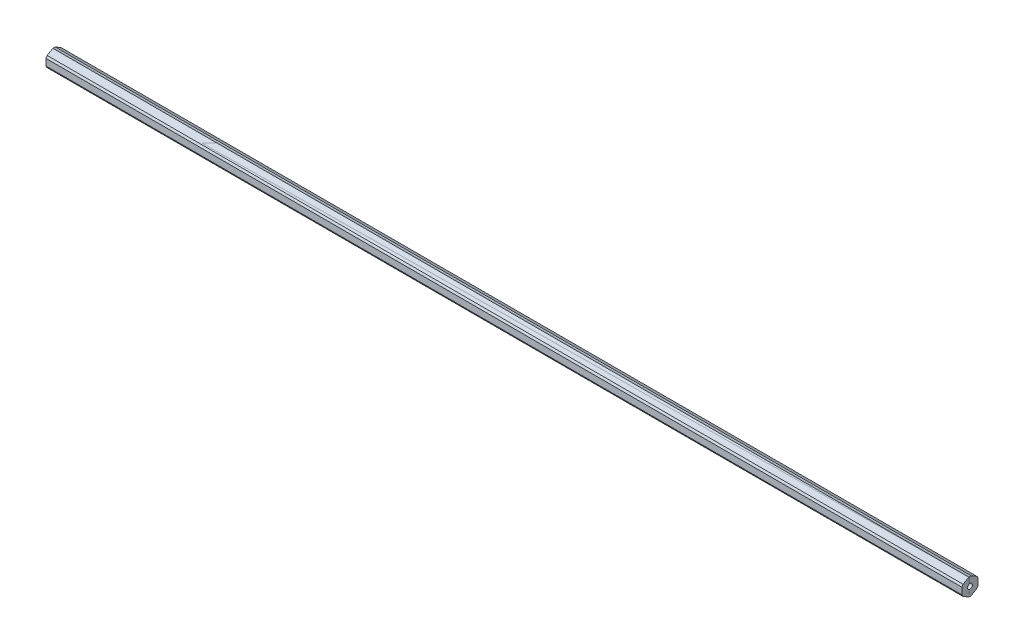
ISO-10303-21;
HEADER;
FILE_DESCRIPTION(('STEP AP214'),'2;1');
FILE_NAME('part.step','',(''),(''),'','','');
FILE_SCHEMA(('AUTOMOTIVE_DESIGN { 1 0 10303 214 1 1 1 1 }'));
ENDSEC;
DATA;
#1=APPLICATION_CONTEXT('core data for automotive mechanical design processes');
#2=APPLICATION_PROTOCOL_DEFINITION('international standard','automotive_design',2000,#1);
#3=PRODUCT_CONTEXT('',#1,'mechanical');
#4=PRODUCT('Part','Part','',(#3));
#5=PRODUCT_RELATED_PRODUCT_CATEGORY('part','',(#4));
#6=PRODUCT_DEFINITION_FORMATION('','',#4);
#7=PRODUCT_DEFINITION_CONTEXT('part definition',#1,'design');
#8=PRODUCT_DEFINITION('design','',#6,#7);
#9=PRODUCT_DEFINITION_SHAPE('','',#8);
#10=(LENGTH_UNIT() NAMED_UNIT(*) SI_UNIT(.MILLI.,.METRE.));
#11=(NAMED_UNIT(*) PLANE_ANGLE_UNIT() SI_UNIT($,.RADIAN.));
#12=(NAMED_UNIT(*) SI_UNIT($,.STERADIAN.) SOLID_ANGLE_UNIT());
#13=UNCERTAINTY_MEASURE_WITH_UNIT(LENGTH_MEASURE(1.E-05),#10,'distance_accuracy_value','');
#14=(GEOMETRIC_REPRESENTATION_CONTEXT(3) GLOBAL_UNCERTAINTY_ASSIGNED_CONTEXT((#13)) GLOBAL_UNIT_ASSIGNED_CONTEXT((#10,
#11,#12)) REPRESENTATION_CONTEXT('',''));
#15=CARTESIAN_POINT('',(0.,0.,0.));
#16=DIRECTION('',(0.,0.,1.));
#17=DIRECTION('',(1.,0.,0.));
#18=AXIS2_PLACEMENT_3D('',#15,#16,#17);
#19=CARTESIAN_POINT('',(552.45,0.,0.));
#20=DIRECTION('',(1.,0.,0.));
#21=DIRECTION('',(0.,0.,-1.));
#22=AXIS2_PLACEMENT_3D('',#19,#20,#21);
#23=CYLINDRICAL_SURFACE('',#22,6.865);
#24=CARTESIAN_POINT('',(1276.35,0.,0.));
#25=DIRECTION('',(1.,0.,0.));
#26=DIRECTION('',(0.,0.,-1.));
#27=AXIS2_PLACEMENT_3D('',#24,#25,#26);
#28=CIRCLE('',#27,6.865);
#29=CARTESIAN_POINT('',(1276.35,-2.608778449773,6.35));
#30=VERTEX_POINT('',#29);
#31=CARTESIAN_POINT('',(1276.35,-4.19487208914468,5.43426841034881));
#32=VERTEX_POINT('',#31);
#33=EDGE_CURVE('E169',#30,#32,#28,.T.);
#34=ORIENTED_EDGE('',*,*,#33,.F.);
#35=DIRECTION('',(1.,0.,0.));
#36=VECTOR('',#35,1.);
#37=CARTESIAN_POINT('',(552.45,-2.608778449773,6.35));
#38=LINE('',#37,#36);
#39=CARTESIAN_POINT('',(552.45,-2.608778449773,6.35));
#40=VERTEX_POINT('',#39);
#41=EDGE_CURVE('E12',#40,#30,#38,.T.);
#42=ORIENTED_EDGE('',*,*,#41,.F.);
#43=CARTESIAN_POINT('',(552.45,0.,0.));
#44=DIRECTION('',(1.,0.,0.));
#45=DIRECTION('',(0.,0.,-1.));
#46=AXIS2_PLACEMENT_3D('',#43,#44,#45);
#47=CIRCLE('',#46,6.865);
#48=CARTESIAN_POINT('',(552.45,-4.19487208914468,5.43426841034881));
#49=VERTEX_POINT('',#48);
#50=EDGE_CURVE('E202',#40,#49,#47,.T.);
#51=ORIENTED_EDGE('',*,*,#50,.T.);
#52=DIRECTION('',(1.,0.,0.));
#53=VECTOR('',#52,1.);
#54=CARTESIAN_POINT('',(552.45,-4.19487208914468,5.43426841034881));
#55=LINE('',#54,#53);
#56=EDGE_CURVE('E55',#49,#32,#55,.T.);
#57=ORIENTED_EDGE('',*,*,#56,.T.);
#58=EDGE_LOOP('',(#34,#42,#51,#57));
#59=FACE_BOUND('',#58,.T.);
#60=ADVANCED_FACE('F47',(#59),#23,.T.);
#61=CARTESIAN_POINT('',(552.45,2.608778449773,6.35));
#62=DIRECTION('',(0.,0.,1.));
#63=DIRECTION('',(1.,0.,0.));
#64=AXIS2_PLACEMENT_3D('',#61,#62,#63);
#65=PLANE('',#64);
#66=DIRECTION('',(0.,-1.,0.));
#67=VECTOR('',#66,1.);
#68=CARTESIAN_POINT('',(1276.35,2.608778449773,6.35));
#69=LINE('',#68,#67);
#70=CARTESIAN_POINT('',(1276.35,2.608778449773,6.35));
#71=VERTEX_POINT('',#70);
#72=EDGE_CURVE('E201',#71,#30,#69,.T.);
#73=ORIENTED_EDGE('',*,*,#72,.F.);
#74=DIRECTION('',(1.,0.,0.));
#75=VECTOR('',#74,1.);
#76=CARTESIAN_POINT('',(552.45,2.608778449773,6.35));
#77=LINE('',#76,#75);
#78=CARTESIAN_POINT('',(552.45,2.608778449773,6.35));
#79=VERTEX_POINT('',#78);
#80=EDGE_CURVE('E59',#79,#71,#77,.T.);
#81=ORIENTED_EDGE('',*,*,#80,.F.);
#82=DIRECTION('',(0.,-1.,0.));
#83=VECTOR('',#82,1.);
#84=CARTESIAN_POINT('',(552.45,2.608778449773,6.35));
#85=LINE('',#84,#83);
#86=EDGE_CURVE('E158',#79,#40,#85,.T.);
#87=ORIENTED_EDGE('',*,*,#86,.T.);
#88=ORIENTED_EDGE('',*,*,#41,.T.);
#89=EDGE_LOOP('',(#73,#81,#87,#88));
#90=FACE_BOUND('',#89,.T.);
#91=ADVANCED_FACE('F221',(#90),#65,.T.);
#92=CARTESIAN_POINT('',(552.45,0.,0.));
#93=DIRECTION('',(1.,0.,0.));
#94=DIRECTION('',(0.,0.,-1.));
#95=AXIS2_PLACEMENT_3D('',#92,#93,#94);
#96=CYLINDRICAL_SURFACE('',#95,6.865);
#97=CARTESIAN_POINT('',(1276.35,0.,0.));
#98=DIRECTION('',(1.,0.,0.));
#99=DIRECTION('',(0.,0.,-1.));
#100=AXIS2_PLACEMENT_3D('',#97,#98,#99);
#101=CIRCLE('',#100,6.865);
#102=CARTESIAN_POINT('',(1276.35,4.19487208914468,5.43426841034881));
#103=VERTEX_POINT('',#102);
#104=EDGE_CURVE('E150',#103,#71,#101,.T.);
#105=ORIENTED_EDGE('',*,*,#104,.F.);
#106=DIRECTION('',(1.,0.,0.));
#107=VECTOR('',#106,1.);
#108=CARTESIAN_POINT('',(552.45,4.19487208914468,5.43426841034881));
#109=LINE('',#108,#107);
#110=CARTESIAN_POINT('',(552.45,4.19487208914468,5.43426841034881));
#111=VERTEX_POINT('',#110);
#112=EDGE_CURVE('E145',#111,#103,#109,.T.);
#113=ORIENTED_EDGE('',*,*,#112,.F.);
#114=CARTESIAN_POINT('',(552.45,0.,0.));
#115=DIRECTION('',(1.,0.,0.));
#116=DIRECTION('',(0.,0.,-1.));
#117=AXIS2_PLACEMENT_3D('',#114,#115,#116);
#118=CIRCLE('',#117,6.865);
#119=EDGE_CURVE('E144',#111,#79,#118,.T.);
#120=ORIENTED_EDGE('',*,*,#119,.T.);
#121=ORIENTED_EDGE('',*,*,#80,.T.);
#122=EDGE_LOOP('',(#105,#113,#120,#121));
#123=FACE_BOUND('',#122,.T.);
#124=ADVANCED_FACE('F142',(#123),#96,.T.);
#125=CARTESIAN_POINT('',(552.45,6.80365053891768,0.915731589651197));
#126=DIRECTION('',(0.,0.866025403784439,0.5));
#127=DIRECTION('',(0.,-0.5,0.866025403784439));
#128=AXIS2_PLACEMENT_3D('',#125,#126,#127);
#129=PLANE('',#128);
#130=DIRECTION('',(0.,-0.5,0.866025403784439));
#131=VECTOR('',#130,1.);
#132=CARTESIAN_POINT('',(1276.35,6.80365053891768,0.915731589651197));
#133=LINE('',#132,#131);
#134=CARTESIAN_POINT('',(1276.35,6.80365053891768,0.915731589651197));
#135=VERTEX_POINT('',#134);
#136=EDGE_CURVE('E198',#135,#103,#133,.T.);
#137=ORIENTED_EDGE('',*,*,#136,.F.);
#138=DIRECTION('',(1.,0.,0.));
#139=VECTOR('',#138,1.);
#140=CARTESIAN_POINT('',(552.45,6.80365053891768,0.915731589651197));
#141=LINE('',#140,#139);
#142=CARTESIAN_POINT('',(552.45,6.80365053891768,0.915731589651197));
#143=VERTEX_POINT('',#142);
#144=EDGE_CURVE('E155',#143,#135,#141,.T.);
#145=ORIENTED_EDGE('',*,*,#144,.F.);
#146=DIRECTION('',(0.,-0.5,0.866025403784439));
#147=VECTOR('',#146,1.);
#148=CARTESIAN_POINT('',(552.45,6.80365053891768,0.915731589651197));
#149=LINE('',#148,#147);
#150=EDGE_CURVE('E159',#143,#111,#149,.T.);
#151=ORIENTED_EDGE('',*,*,#150,.T.);
#152=ORIENTED_EDGE('',*,*,#112,.T.);
#153=EDGE_LOOP('',(#137,#145,#151,#152));
#154=FACE_BOUND('',#153,.T.);
#155=ADVANCED_FACE('F165',(#154),#129,.T.);
#156=CARTESIAN_POINT('',(552.45,0.,0.));
#157=DIRECTION('',(1.,0.,0.));
#158=DIRECTION('',(0.,0.,-1.));
#159=AXIS2_PLACEMENT_3D('',#156,#157,#158);
#160=CYLINDRICAL_SURFACE('',#159,6.865);
#161=CARTESIAN_POINT('',(1276.35,0.,0.));
#162=DIRECTION('',(1.,0.,0.));
#163=DIRECTION('',(0.,0.,-1.));
#164=AXIS2_PLACEMENT_3D('',#161,#162,#163);
#165=CIRCLE('',#164,6.865);
#166=CARTESIAN_POINT('',(1276.35,6.80365053891768,-0.915731589651197));
#167=VERTEX_POINT('',#166);
#168=EDGE_CURVE('E194',#167,#135,#165,.T.);
#169=ORIENTED_EDGE('',*,*,#168,.F.);
#170=DIRECTION('',(1.,0.,0.));
#171=VECTOR('',#170,1.);
#172=CARTESIAN_POINT('',(552.45,6.80365053891768,-0.915731589651197));
#173=LINE('',#172,#171);
#174=CARTESIAN_POINT('',(552.45,6.80365053891768,-0.915731589651197));
#175=VERTEX_POINT('',#174);
#176=EDGE_CURVE('E210',#175,#167,#173,.T.);
#177=ORIENTED_EDGE('',*,*,#176,.F.);
#178=CARTESIAN_POINT('',(552.45,0.,0.));
#179=DIRECTION('',(1.,0.,0.));
#180=DIRECTION('',(0.,0.,-1.));
#181=AXIS2_PLACEMENT_3D('',#178,#179,#180);
#182=CIRCLE('',#181,6.865);
#183=EDGE_CURVE('E161',#175,#143,#182,.T.);
#184=ORIENTED_EDGE('',*,*,#183,.T.);
#185=ORIENTED_EDGE('',*,*,#144,.T.);
#186=EDGE_LOOP('',(#169,#177,#184,#185));
#187=FACE_BOUND('',#186,.T.);
#188=ADVANCED_FACE('F238',(#187),#160,.T.);
#189=CARTESIAN_POINT('',(552.45,4.19487208914468,-5.43426841034881));
#190=DIRECTION('',(0.,0.866025403784439,-0.5));
#191=DIRECTION('',(0.,0.5,0.866025403784439));
#192=AXIS2_PLACEMENT_3D('',#189,#190,#191);
#193=PLANE('',#192);
#194=DIRECTION('',(0.,0.5,0.866025403784439));
#195=VECTOR('',#194,1.);
#196=CARTESIAN_POINT('',(1276.35,4.19487208914468,-5.43426841034881));
#197=LINE('',#196,#195);
#198=CARTESIAN_POINT('',(1276.35,4.19487208914468,-5.43426841034881));
#199=VERTEX_POINT('',#198);
#200=EDGE_CURVE('E195',#199,#167,#197,.T.);
#201=ORIENTED_EDGE('',*,*,#200,.F.);
#202=DIRECTION('',(1.,0.,0.));
#203=VECTOR('',#202,1.);
#204=CARTESIAN_POINT('',(552.45,4.19487208914468,-5.43426841034881));
#205=LINE('',#204,#203);
#206=CARTESIAN_POINT('',(552.45,4.19487208914468,-5.43426841034881));
#207=VERTEX_POINT('',#206);
#208=EDGE_CURVE('E206',#207,#199,#205,.T.);
#209=ORIENTED_EDGE('',*,*,#208,.F.);
#210=DIRECTION('',(0.,0.5,0.866025403784439));
#211=VECTOR('',#210,1.);
#212=CARTESIAN_POINT('',(552.45,4.19487208914468,-5.43426841034881));
#213=LINE('',#212,#211);
#214=EDGE_CURVE('E164',#207,#175,#213,.T.);
#215=ORIENTED_EDGE('',*,*,#214,.T.);
#216=ORIENTED_EDGE('',*,*,#176,.T.);
#217=EDGE_LOOP('',(#201,#209,#215,#216));
#218=FACE_BOUND('',#217,.T.);
#219=ADVANCED_FACE('F239',(#218),#193,.T.);
#220=CARTESIAN_POINT('',(552.45,0.,0.));
#221=DIRECTION('',(1.,0.,0.));
#222=DIRECTION('',(0.,0.,-1.));
#223=AXIS2_PLACEMENT_3D('',#220,#221,#222);
#224=CYLINDRICAL_SURFACE('',#223,6.865);
#225=CARTESIAN_POINT('',(1276.35,0.,0.));
#226=DIRECTION('',(1.,0.,0.));
#227=DIRECTION('',(0.,0.,-1.));
#228=AXIS2_PLACEMENT_3D('',#225,#226,#227);
#229=CIRCLE('',#228,6.865);
#230=CARTESIAN_POINT('',(1276.35,2.608778449773,-6.35));
#231=VERTEX_POINT('',#230);
#232=EDGE_CURVE('E189',#231,#199,#229,.T.);
#233=ORIENTED_EDGE('',*,*,#232,.F.);
#234=DIRECTION('',(1.,0.,0.));
#235=VECTOR('',#234,1.);
#236=CARTESIAN_POINT('',(552.45,2.608778449773,-6.35));
#237=LINE('',#236,#235);
#238=CARTESIAN_POINT('',(552.45,2.608778449773,-6.35));
#239=VERTEX_POINT('',#238);
#240=EDGE_CURVE('E213',#239,#231,#237,.T.);
#241=ORIENTED_EDGE('',*,*,#240,.F.);
#242=CARTESIAN_POINT('',(552.45,0.,0.));
#243=DIRECTION('',(1.,0.,0.));
#244=DIRECTION('',(0.,0.,-1.));
#245=AXIS2_PLACEMENT_3D('',#242,#243,#244);
#246=CIRCLE('',#245,6.865);
#247=EDGE_CURVE('E305',#239,#207,#246,.T.);
#248=ORIENTED_EDGE('',*,*,#247,.T.);
#249=ORIENTED_EDGE('',*,*,#208,.T.);
#250=EDGE_LOOP('',(#233,#241,#248,#249));
#251=FACE_BOUND('',#250,.T.);
#252=ADVANCED_FACE('F243',(#251),#224,.T.);
#253=CARTESIAN_POINT('',(552.45,-2.608778449773,-6.35));
#254=DIRECTION('',(0.,0.,-1.));
#255=DIRECTION('',(-1.,0.,0.));
#256=AXIS2_PLACEMENT_3D('',#253,#254,#255);
#257=PLANE('',#256);
#258=DIRECTION('',(0.,1.,0.));
#259=VECTOR('',#258,1.);
#260=CARTESIAN_POINT('',(1276.35,-2.608778449773,-6.35));
#261=LINE('',#260,#259);
#262=CARTESIAN_POINT('',(1276.35,-2.608778449773,-6.35));
#263=VERTEX_POINT('',#262);
#264=EDGE_CURVE('E188',#263,#231,#261,.T.);
#265=ORIENTED_EDGE('',*,*,#264,.F.);
#266=DIRECTION('',(1.,0.,0.));
#267=VECTOR('',#266,1.);
#268=CARTESIAN_POINT('',(552.45,-2.608778449773,-6.35));
#269=LINE('',#268,#267);
#270=CARTESIAN_POINT('',(552.45,-2.608778449773,-6.35));
#271=VERTEX_POINT('',#270);
#272=EDGE_CURVE('E211',#271,#263,#269,.T.);
#273=ORIENTED_EDGE('',*,*,#272,.F.);
#274=DIRECTION('',(0.,1.,0.));
#275=VECTOR('',#274,1.);
#276=CARTESIAN_POINT('',(552.45,-2.608778449773,-6.35));
#277=LINE('',#276,#275);
#278=EDGE_CURVE('E297',#271,#239,#277,.T.);
#279=ORIENTED_EDGE('',*,*,#278,.T.);
#280=ORIENTED_EDGE('',*,*,#240,.T.);
#281=EDGE_LOOP('',(#265,#273,#279,#280));
#282=FACE_BOUND('',#281,.T.);
#283=ADVANCED_FACE('F250',(#282),#257,.T.);
#284=CARTESIAN_POINT('',(552.45,0.,0.));
#285=DIRECTION('',(1.,0.,0.));
#286=DIRECTION('',(0.,0.,-1.));
#287=AXIS2_PLACEMENT_3D('',#284,#285,#286);
#288=CYLINDRICAL_SURFACE('',#287,6.865);
#289=CARTESIAN_POINT('',(1276.35,0.,0.));
#290=DIRECTION('',(1.,0.,0.));
#291=DIRECTION('',(0.,0.,-1.));
#292=AXIS2_PLACEMENT_3D('',#289,#290,#291);
#293=CIRCLE('',#292,6.865);
#294=CARTESIAN_POINT('',(1276.35,-4.19487208914468,-5.43426841034881));
#295=VERTEX_POINT('',#294);
#296=EDGE_CURVE('E181',#295,#263,#293,.T.);
#297=ORIENTED_EDGE('',*,*,#296,.F.);
#298=DIRECTION('',(1.,0.,0.));
#299=VECTOR('',#298,1.);
#300=CARTESIAN_POINT('',(552.45,-4.19487208914468,-5.43426841034881));
#301=LINE('',#300,#299);
#302=CARTESIAN_POINT('',(552.45,-4.19487208914468,-5.43426841034881));
#303=VERTEX_POINT('',#302);
#304=EDGE_CURVE('E214',#303,#295,#301,.T.);
#305=ORIENTED_EDGE('',*,*,#304,.F.);
#306=CARTESIAN_POINT('',(552.45,0.,0.));
#307=DIRECTION('',(1.,0.,0.));
#308=DIRECTION('',(0.,0.,-1.));
#309=AXIS2_PLACEMENT_3D('',#306,#307,#308);
#310=CIRCLE('',#309,6.865);
#311=EDGE_CURVE('E296',#303,#271,#310,.T.);
#312=ORIENTED_EDGE('',*,*,#311,.T.);
#313=ORIENTED_EDGE('',*,*,#272,.T.);
#314=EDGE_LOOP('',(#297,#305,#312,#313));
#315=FACE_BOUND('',#314,.T.);
#316=ADVANCED_FACE('F251',(#315),#288,.T.);
#317=CARTESIAN_POINT('',(552.45,-6.80365053891768,-0.915731589651192));
#318=DIRECTION('',(0.,-0.866025403784439,-0.499999999999999));
#319=DIRECTION('',(0.,0.499999999999999,-0.866025403784439));
#320=AXIS2_PLACEMENT_3D('',#317,#318,#319);
#321=PLANE('',#320);
#322=DIRECTION('',(0.,0.499999999999999,-0.866025403784439));
#323=VECTOR('',#322,1.);
#324=CARTESIAN_POINT('',(1276.35,-6.80365053891768,-0.915731589651192));
#325=LINE('',#324,#323);
#326=CARTESIAN_POINT('',(1276.35,-6.80365053891768,-0.915731589651192));
#327=VERTEX_POINT('',#326);
#328=EDGE_CURVE('E179',#327,#295,#325,.T.);
#329=ORIENTED_EDGE('',*,*,#328,.F.);
#330=DIRECTION('',(1.,0.,0.));
#331=VECTOR('',#330,1.);
#332=CARTESIAN_POINT('',(552.45,-6.80365053891768,-0.915731589651192));
#333=LINE('',#332,#331);
#334=CARTESIAN_POINT('',(552.45,-6.80365053891768,-0.915731589651192));
#335=VERTEX_POINT('',#334);
#336=EDGE_CURVE('E220',#335,#327,#333,.T.);
#337=ORIENTED_EDGE('',*,*,#336,.F.);
#338=DIRECTION('',(0.,0.499999999999999,-0.866025403784439));
#339=VECTOR('',#338,1.);
#340=CARTESIAN_POINT('',(552.45,-6.80365053891768,-0.915731589651192));
#341=LINE('',#340,#339);
#342=EDGE_CURVE('E293',#335,#303,#341,.T.);
#343=ORIENTED_EDGE('',*,*,#342,.T.);
#344=ORIENTED_EDGE('',*,*,#304,.T.);
#345=EDGE_LOOP('',(#329,#337,#343,#344));
#346=FACE_BOUND('',#345,.T.);
#347=ADVANCED_FACE('F254',(#346),#321,.T.);
#348=CARTESIAN_POINT('',(552.45,0.,0.));
#349=DIRECTION('',(1.,0.,0.));
#350=DIRECTION('',(0.,0.,-1.));
#351=AXIS2_PLACEMENT_3D('',#348,#349,#350);
#352=CYLINDRICAL_SURFACE('',#351,6.86499999999999);
#353=CARTESIAN_POINT('',(1276.35,0.,0.));
#354=DIRECTION('',(1.,0.,0.));
#355=DIRECTION('',(0.,0.,-1.));
#356=AXIS2_PLACEMENT_3D('',#353,#354,#355);
#357=CIRCLE('',#356,6.86499999999999);
#358=CARTESIAN_POINT('',(1276.35,-6.80365053891768,0.915731589651186));
#359=VERTEX_POINT('',#358);
#360=EDGE_CURVE('E180',#359,#327,#357,.T.);
#361=ORIENTED_EDGE('',*,*,#360,.F.);
#362=DIRECTION('',(1.,0.,0.));
#363=VECTOR('',#362,1.);
#364=CARTESIAN_POINT('',(552.45,-6.80365053891768,0.915731589651186));
#365=LINE('',#364,#363);
#366=CARTESIAN_POINT('',(552.45,-6.80365053891768,0.915731589651186));
#367=VERTEX_POINT('',#366);
#368=EDGE_CURVE('E218',#367,#359,#365,.T.);
#369=ORIENTED_EDGE('',*,*,#368,.F.);
#370=CARTESIAN_POINT('',(552.45,0.,0.));
#371=DIRECTION('',(1.,0.,0.));
#372=DIRECTION('',(0.,0.,-1.));
#373=AXIS2_PLACEMENT_3D('',#370,#371,#372);
#374=CIRCLE('',#373,6.86499999999999);
#375=EDGE_CURVE('E287',#367,#335,#374,.T.);
#376=ORIENTED_EDGE('',*,*,#375,.T.);
#377=ORIENTED_EDGE('',*,*,#336,.T.);
#378=EDGE_LOOP('',(#361,#369,#376,#377));
#379=FACE_BOUND('',#378,.T.);
#380=ADVANCED_FACE('F256',(#379),#352,.T.);
#381=CARTESIAN_POINT('',(552.45,-4.19487208914468,5.43426841034881));
#382=DIRECTION('',(0.,-0.866025403784439,0.499999999999999));
#383=DIRECTION('',(0.,-0.499999999999999,-0.866025403784439));
#384=AXIS2_PLACEMENT_3D('',#381,#382,#383);
#385=PLANE('',#384);
#386=DIRECTION('',(0.,-0.499999999999999,-0.866025403784439));
#387=VECTOR('',#386,1.);
#388=CARTESIAN_POINT('',(1276.35,-4.19487208914468,5.43426841034881));
#389=LINE('',#388,#387);
#390=EDGE_CURVE('E171',#32,#359,#389,.T.);
#391=ORIENTED_EDGE('',*,*,#390,.F.);
#392=ORIENTED_EDGE('',*,*,#56,.F.);
#393=DIRECTION('',(0.,-0.499999999999999,-0.866025403784439));
#394=VECTOR('',#393,1.);
#395=CARTESIAN_POINT('',(552.45,-4.19487208914468,5.43426841034881));
#396=LINE('',#395,#394);
#397=EDGE_CURVE('E286',#49,#367,#396,.T.);
#398=ORIENTED_EDGE('',*,*,#397,.T.);
#399=ORIENTED_EDGE('',*,*,#368,.T.);
#400=EDGE_LOOP('',(#391,#392,#398,#399));
#401=FACE_BOUND('',#400,.T.);
#402=ADVANCED_FACE('F219',(#401),#385,.T.);
#403=CARTESIAN_POINT('',(552.45,0.,0.));
#404=DIRECTION('',(1.,0.,0.));
#405=DIRECTION('',(0.,0.,-1.));
#406=AXIS2_PLACEMENT_3D('',#403,#404,#405);
#407=PLANE('',#406);
#408=CARTESIAN_POINT('',(552.45,0.,0.));
#409=DIRECTION('',(1.,0.,0.));
#410=DIRECTION('',(0.,0.,1.));
#411=AXIS2_PLACEMENT_3D('',#408,#409,#410);
#412=CIRCLE('',#411,1.9939);
#413=CARTESIAN_POINT('',(552.45,0.,1.9939));
#414=VERTEX_POINT('',#413);
#415=EDGE_CURVE('E174',#414,#414,#412,.T.);
#416=ORIENTED_EDGE('',*,*,#415,.T.);
#417=EDGE_LOOP('',(#416));
#418=FACE_BOUND('',#417,.T.);
#419=ORIENTED_EDGE('',*,*,#50,.F.);
#420=ORIENTED_EDGE('',*,*,#86,.F.);
#421=ORIENTED_EDGE('',*,*,#119,.F.);
#422=ORIENTED_EDGE('',*,*,#150,.F.);
#423=ORIENTED_EDGE('',*,*,#183,.F.);
#424=ORIENTED_EDGE('',*,*,#214,.F.);
#425=ORIENTED_EDGE('',*,*,#247,.F.);
#426=ORIENTED_EDGE('',*,*,#278,.F.);
#427=ORIENTED_EDGE('',*,*,#311,.F.);
#428=ORIENTED_EDGE('',*,*,#342,.F.);
#429=ORIENTED_EDGE('',*,*,#375,.F.);
#430=ORIENTED_EDGE('',*,*,#397,.F.);
#431=EDGE_LOOP('',(#419,#420,#421,#422,#423,#424,#425,#426,#427,#428,#429,#430));
#432=FACE_BOUND('',#431,.T.);
#433=ADVANCED_FACE('F157',(#418,#432),#407,.F.);
#434=CARTESIAN_POINT('',(1276.35,0.,0.));
#435=DIRECTION('',(1.,0.,0.));
#436=DIRECTION('',(0.,0.,-1.));
#437=AXIS2_PLACEMENT_3D('',#434,#435,#436);
#438=PLANE('',#437);
#439=CARTESIAN_POINT('',(1276.35,0.,0.));
#440=DIRECTION('',(1.,0.,0.));
#441=DIRECTION('',(0.,0.,1.));
#442=AXIS2_PLACEMENT_3D('',#439,#440,#441);
#443=CIRCLE('',#442,1.9939);
#444=CARTESIAN_POINT('',(1276.35,0.,1.9939));
#445=VERTEX_POINT('',#444);
#446=EDGE_CURVE('E281',#445,#445,#443,.T.);
#447=ORIENTED_EDGE('',*,*,#446,.F.);
#448=EDGE_LOOP('',(#447));
#449=FACE_BOUND('',#448,.T.);
#450=ORIENTED_EDGE('',*,*,#33,.T.);
#451=ORIENTED_EDGE('',*,*,#390,.T.);
#452=ORIENTED_EDGE('',*,*,#360,.T.);
#453=ORIENTED_EDGE('',*,*,#328,.T.);
#454=ORIENTED_EDGE('',*,*,#296,.T.);
#455=ORIENTED_EDGE('',*,*,#264,.T.);
#456=ORIENTED_EDGE('',*,*,#232,.T.);
#457=ORIENTED_EDGE('',*,*,#200,.T.);
#458=ORIENTED_EDGE('',*,*,#168,.T.);
#459=ORIENTED_EDGE('',*,*,#136,.T.);
#460=ORIENTED_EDGE('',*,*,#104,.T.);
#461=ORIENTED_EDGE('',*,*,#72,.T.);
#462=EDGE_LOOP('',(#450,#451,#452,#453,#454,#455,#456,#457,#458,#459,#460,#461));
#463=FACE_BOUND('',#462,.T.);
#464=ADVANCED_FACE('F225',(#449,#463),#438,.T.);
#465=CARTESIAN_POINT('',(552.45,0.,0.));
#466=DIRECTION('',(1.,0.,0.));
#467=DIRECTION('',(0.,0.,-1.));
#468=AXIS2_PLACEMENT_3D('',#465,#466,#467);
#469=CYLINDRICAL_SURFACE('',#468,1.9939);
#470=ORIENTED_EDGE('',*,*,#415,.F.);
#471=EDGE_LOOP('',(#470));
#472=FACE_BOUND('',#471,.T.);
#473=ORIENTED_EDGE('',*,*,#446,.T.);
#474=EDGE_LOOP('',(#473));
#475=FACE_BOUND('',#474,.T.);
#476=ADVANCED_FACE('F272',(#472,#475),#469,.F.);
#477=CLOSED_SHELL('',(#60,#91,#124,#155,#188,#219,#252,#283,#316,#347,#380,#402,#433,#464,#476));
#478=MANIFOLD_SOLID_BREP('B2',#477);
#479=CARTESIAN_POINT('',(552.45,0.,0.));
#480=DIRECTION('',(1.,0.,0.));
#481=DIRECTION('',(0.,0.,-1.));
#482=AXIS2_PLACEMENT_3D('',#479,#480,#481);
#483=CYLINDRICAL_SURFACE('',#482,6.865);
#484=CARTESIAN_POINT('',(1276.35,0.,0.));
#485=DIRECTION('',(1.,0.,0.));
#486=DIRECTION('',(0.,0.,-1.));
#487=AXIS2_PLACEMENT_3D('',#484,#485,#486);
#488=CIRCLE('',#487,6.865);
#489=CARTESIAN_POINT('',(1276.35,-2.608778449773,6.35));
#490=VERTEX_POINT('',#489);
#491=CARTESIAN_POINT('',(1276.35,-4.19487208914468,5.43426841034881));
#492=VERTEX_POINT('',#491);
#493=EDGE_CURVE('E521',#490,#492,#488,.T.);
#494=ORIENTED_EDGE('',*,*,#493,.F.);
#495=DIRECTION('',(1.,0.,0.));
#496=VECTOR('',#495,1.);
#497=CARTESIAN_POINT('',(552.45,-2.608778449773,6.35));
#498=LINE('',#497,#496);
#499=CARTESIAN_POINT('',(552.45,-2.608778449773,6.35));
#500=VERTEX_POINT('',#499);
#501=EDGE_CURVE('E50',#500,#490,#498,.T.);
#502=ORIENTED_EDGE('',*,*,#501,.F.);
#503=CARTESIAN_POINT('',(552.45,0.,0.));
#504=DIRECTION('',(1.,0.,0.));
#505=DIRECTION('',(0.,0.,-1.));
#506=AXIS2_PLACEMENT_3D('',#503,#504,#505);
#507=CIRCLE('',#506,6.865);
#508=CARTESIAN_POINT('',(552.45,-4.19487208914468,5.43426841034881));
#509=VERTEX_POINT('',#508);
#510=EDGE_CURVE('E557',#500,#509,#507,.T.);
#511=ORIENTED_EDGE('',*,*,#510,.T.);
#512=DIRECTION('',(1.,0.,0.));
#513=VECTOR('',#512,1.);
#514=CARTESIAN_POINT('',(552.45,-4.19487208914468,5.43426841034881));
#515=LINE('',#514,#513);
#516=EDGE_CURVE('E404',#509,#492,#515,.T.);
#517=ORIENTED_EDGE('',*,*,#516,.T.);
#518=EDGE_LOOP('',(#494,#502,#511,#517));
#519=FACE_BOUND('',#518,.T.);
#520=ADVANCED_FACE('F405',(#519),#483,.T.);
#521=CARTESIAN_POINT('',(552.45,2.608778449773,6.35));
#522=DIRECTION('',(0.,0.,1.));
#523=DIRECTION('',(1.,0.,0.));
#524=AXIS2_PLACEMENT_3D('',#521,#522,#523);
#525=PLANE('',#524);
#526=DIRECTION('',(0.,-1.,0.));
#527=VECTOR('',#526,1.);
#528=CARTESIAN_POINT('',(1276.35,2.608778449773,6.35));
#529=LINE('',#528,#527);
#530=CARTESIAN_POINT('',(1276.35,2.608778449773,6.35));
#531=VERTEX_POINT('',#530);
#532=EDGE_CURVE('E553',#531,#490,#529,.T.);
#533=ORIENTED_EDGE('',*,*,#532,.F.);
#534=DIRECTION('',(1.,0.,0.));
#535=VECTOR('',#534,1.);
#536=CARTESIAN_POINT('',(552.45,2.608778449773,6.35));
#537=LINE('',#536,#535);
#538=CARTESIAN_POINT('',(552.45,2.608778449773,6.35));
#539=VERTEX_POINT('',#538);
#540=EDGE_CURVE('E413',#539,#531,#537,.T.);
#541=ORIENTED_EDGE('',*,*,#540,.F.);
#542=DIRECTION('',(0.,-1.,0.));
#543=VECTOR('',#542,1.);
#544=CARTESIAN_POINT('',(552.45,2.608778449773,6.35));
#545=LINE('',#544,#543);
#546=EDGE_CURVE('E511',#539,#500,#545,.T.);
#547=ORIENTED_EDGE('',*,*,#546,.T.);
#548=ORIENTED_EDGE('',*,*,#501,.T.);
#549=EDGE_LOOP('',(#533,#541,#547,#548));
#550=FACE_BOUND('',#549,.T.);
#551=ADVANCED_FACE('F576',(#550),#525,.T.);
#552=CARTESIAN_POINT('',(552.45,0.,0.));
#553=DIRECTION('',(1.,0.,0.));
#554=DIRECTION('',(0.,0.,-1.));
#555=AXIS2_PLACEMENT_3D('',#552,#553,#554);
#556=CYLINDRICAL_SURFACE('',#555,6.865);
#557=CARTESIAN_POINT('',(1276.35,0.,0.));
#558=DIRECTION('',(1.,0.,0.));
#559=DIRECTION('',(0.,0.,-1.));
#560=AXIS2_PLACEMENT_3D('',#557,#558,#559);
#561=CIRCLE('',#560,6.865);
#562=CARTESIAN_POINT('',(1276.35,4.19487208914468,5.43426841034881));
#563=VERTEX_POINT('',#562);
#564=EDGE_CURVE('E499',#563,#531,#561,.T.);
#565=ORIENTED_EDGE('',*,*,#564,.F.);
#566=DIRECTION('',(1.,0.,0.));
#567=VECTOR('',#566,1.);
#568=CARTESIAN_POINT('',(552.45,4.19487208914468,5.43426841034881));
#569=LINE('',#568,#567);
#570=CARTESIAN_POINT('',(552.45,4.19487208914468,5.43426841034881));
#571=VERTEX_POINT('',#570);
#572=EDGE_CURVE('E494',#571,#563,#569,.T.);
#573=ORIENTED_EDGE('',*,*,#572,.F.);
#574=CARTESIAN_POINT('',(552.45,0.,0.));
#575=DIRECTION('',(1.,0.,0.));
#576=DIRECTION('',(0.,0.,-1.));
#577=AXIS2_PLACEMENT_3D('',#574,#575,#576);
#578=CIRCLE('',#577,6.865);
#579=EDGE_CURVE('E498',#571,#539,#578,.T.);
#580=ORIENTED_EDGE('',*,*,#579,.T.);
#581=ORIENTED_EDGE('',*,*,#540,.T.);
#582=EDGE_LOOP('',(#565,#573,#580,#581));
#583=FACE_BOUND('',#582,.T.);
#584=ADVANCED_FACE('F500',(#583),#556,.T.);
#585=CARTESIAN_POINT('',(552.45,6.80365053891768,0.915731589651197));
#586=DIRECTION('',(0.,0.866025403784439,0.5));
#587=DIRECTION('',(0.,-0.5,0.866025403784439));
#588=AXIS2_PLACEMENT_3D('',#585,#586,#587);
#589=PLANE('',#588);
#590=DIRECTION('',(0.,-0.5,0.866025403784439));
#591=VECTOR('',#590,1.);
#592=CARTESIAN_POINT('',(1276.35,6.80365053891768,0.915731589651197));
#593=LINE('',#592,#591);
#594=CARTESIAN_POINT('',(1276.35,6.80365053891768,0.915731589651197));
#595=VERTEX_POINT('',#594);
#596=EDGE_CURVE('E551',#595,#563,#593,.T.);
#597=ORIENTED_EDGE('',*,*,#596,.F.);
#598=DIRECTION('',(1.,0.,0.));
#599=VECTOR('',#598,1.);
#600=CARTESIAN_POINT('',(552.45,6.80365053891768,0.915731589651197));
#601=LINE('',#600,#599);
#602=CARTESIAN_POINT('',(552.45,6.80365053891768,0.915731589651197));
#603=VERTEX_POINT('',#602);
#604=EDGE_CURVE('E504',#603,#595,#601,.T.);
#605=ORIENTED_EDGE('',*,*,#604,.F.);
#606=DIRECTION('',(0.,-0.5,0.866025403784439));
#607=VECTOR('',#606,1.);
#608=CARTESIAN_POINT('',(552.45,6.80365053891768,0.915731589651197));
#609=LINE('',#608,#607);
#610=EDGE_CURVE('E513',#603,#571,#609,.T.);
#611=ORIENTED_EDGE('',*,*,#610,.T.);
#612=ORIENTED_EDGE('',*,*,#572,.T.);
#613=EDGE_LOOP('',(#597,#605,#611,#612));
#614=FACE_BOUND('',#613,.T.);
#615=ADVANCED_FACE('F514',(#614),#589,.T.);
#616=CARTESIAN_POINT('',(552.45,0.,0.));
#617=DIRECTION('',(1.,0.,0.));
#618=DIRECTION('',(0.,0.,-1.));
#619=AXIS2_PLACEMENT_3D('',#616,#617,#618);
#620=CYLINDRICAL_SURFACE('',#619,6.865);
#621=CARTESIAN_POINT('',(1276.35,0.,0.));
#622=DIRECTION('',(1.,0.,0.));
#623=DIRECTION('',(0.,0.,-1.));
#624=AXIS2_PLACEMENT_3D('',#621,#622,#623);
#625=CIRCLE('',#624,6.865);
#626=CARTESIAN_POINT('',(1276.35,6.80365053891768,-0.915731589651197));
#627=VERTEX_POINT('',#626);
#628=EDGE_CURVE('E548',#627,#595,#625,.T.);
#629=ORIENTED_EDGE('',*,*,#628,.F.);
#630=DIRECTION('',(1.,0.,0.));
#631=VECTOR('',#630,1.);
#632=CARTESIAN_POINT('',(552.45,6.80365053891768,-0.915731589651197));
#633=LINE('',#632,#631);
#634=CARTESIAN_POINT('',(552.45,6.80365053891768,-0.915731589651197));
#635=VERTEX_POINT('',#634);
#636=EDGE_CURVE('E558',#635,#627,#633,.T.);
#637=ORIENTED_EDGE('',*,*,#636,.F.);
#638=CARTESIAN_POINT('',(552.45,0.,0.));
#639=DIRECTION('',(1.,0.,0.));
#640=DIRECTION('',(0.,0.,-1.));
#641=AXIS2_PLACEMENT_3D('',#638,#639,#640);
#642=CIRCLE('',#641,6.865);
#643=EDGE_CURVE('E516',#635,#603,#642,.T.);
#644=ORIENTED_EDGE('',*,*,#643,.T.);
#645=ORIENTED_EDGE('',*,*,#604,.T.);
#646=EDGE_LOOP('',(#629,#637,#644,#645));
#647=FACE_BOUND('',#646,.T.);
#648=ADVANCED_FACE('F589',(#647),#620,.T.);
#649=CARTESIAN_POINT('',(552.45,4.19487208914468,-5.43426841034881));
#650=DIRECTION('',(0.,0.866025403784439,-0.5));
#651=DIRECTION('',(0.,0.5,0.866025403784439));
#652=AXIS2_PLACEMENT_3D('',#649,#650,#651);
#653=PLANE('',#652);
#654=DIRECTION('',(0.,0.5,0.866025403784439));
#655=VECTOR('',#654,1.);
#656=CARTESIAN_POINT('',(1276.35,4.19487208914468,-5.43426841034881));
#657=LINE('',#656,#655);
#658=CARTESIAN_POINT('',(1276.35,4.19487208914468,-5.43426841034881));
#659=VERTEX_POINT('',#658);
#660=EDGE_CURVE('E544',#659,#627,#657,.T.);
#661=ORIENTED_EDGE('',*,*,#660,.F.);
#662=DIRECTION('',(1.,0.,0.));
#663=VECTOR('',#662,1.);
#664=CARTESIAN_POINT('',(552.45,4.19487208914468,-5.43426841034881));
#665=LINE('',#664,#663);
#666=CARTESIAN_POINT('',(552.45,4.19487208914468,-5.43426841034881));
#667=VERTEX_POINT('',#666);
#668=EDGE_CURVE('E565',#667,#659,#665,.T.);
#669=ORIENTED_EDGE('',*,*,#668,.F.);
#670=DIRECTION('',(0.,0.5,0.866025403784439));
#671=VECTOR('',#670,1.);
#672=CARTESIAN_POINT('',(552.45,4.19487208914468,-5.43426841034881));
#673=LINE('',#672,#671);
#674=EDGE_CURVE('E518',#667,#635,#673,.T.);
#675=ORIENTED_EDGE('',*,*,#674,.T.);
#676=ORIENTED_EDGE('',*,*,#636,.T.);
#677=EDGE_LOOP('',(#661,#669,#675,#676));
#678=FACE_BOUND('',#677,.T.);
#679=ADVANCED_FACE('F595',(#678),#653,.T.);
#680=CARTESIAN_POINT('',(552.45,0.,0.));
#681=DIRECTION('',(1.,0.,0.));
#682=DIRECTION('',(0.,0.,-1.));
#683=AXIS2_PLACEMENT_3D('',#680,#681,#682);
#684=CYLINDRICAL_SURFACE('',#683,6.865);
#685=CARTESIAN_POINT('',(1276.35,0.,0.));
#686=DIRECTION('',(1.,0.,0.));
#687=DIRECTION('',(0.,0.,-1.));
#688=AXIS2_PLACEMENT_3D('',#685,#686,#687);
#689=CIRCLE('',#688,6.865);
#690=CARTESIAN_POINT('',(1276.35,2.608778449773,-6.35));
#691=VERTEX_POINT('',#690);
#692=EDGE_CURVE('E545',#691,#659,#689,.T.);
#693=ORIENTED_EDGE('',*,*,#692,.F.);
#694=DIRECTION('',(1.,0.,0.));
#695=VECTOR('',#694,1.);
#696=CARTESIAN_POINT('',(552.45,2.608778449773,-6.35));
#697=LINE('',#696,#695);
#698=CARTESIAN_POINT('',(552.45,2.608778449773,-6.35));
#699=VERTEX_POINT('',#698);
#700=EDGE_CURVE('E562',#699,#691,#697,.T.);
#701=ORIENTED_EDGE('',*,*,#700,.F.);
#702=CARTESIAN_POINT('',(552.45,0.,0.));
#703=DIRECTION('',(1.,0.,0.));
#704=DIRECTION('',(0.,0.,-1.));
#705=AXIS2_PLACEMENT_3D('',#702,#703,#704);
#706=CIRCLE('',#705,6.865);
#707=EDGE_CURVE('E654',#699,#667,#706,.T.);
#708=ORIENTED_EDGE('',*,*,#707,.T.);
#709=ORIENTED_EDGE('',*,*,#668,.T.);
#710=EDGE_LOOP('',(#693,#701,#708,#709));
#711=FACE_BOUND('',#710,.T.);
#712=ADVANCED_FACE('F596',(#711),#684,.T.);
#713=CARTESIAN_POINT('',(552.45,-2.608778449773,-6.35));
#714=DIRECTION('',(0.,0.,-1.));
#715=DIRECTION('',(-1.,0.,0.));
#716=AXIS2_PLACEMENT_3D('',#713,#714,#715);
#717=PLANE('',#716);
#718=DIRECTION('',(0.,1.,0.));
#719=VECTOR('',#718,1.);
#720=CARTESIAN_POINT('',(1276.35,-2.608778449773,-6.35));
#721=LINE('',#720,#719);
#722=CARTESIAN_POINT('',(1276.35,-2.608778449773,-6.35));
#723=VERTEX_POINT('',#722);
#724=EDGE_CURVE('E539',#723,#691,#721,.T.);
#725=ORIENTED_EDGE('',*,*,#724,.F.);
#726=DIRECTION('',(1.,0.,0.));
#727=VECTOR('',#726,1.);
#728=CARTESIAN_POINT('',(552.45,-2.608778449773,-6.35));
#729=LINE('',#728,#727);
#730=CARTESIAN_POINT('',(552.45,-2.608778449773,-6.35));
#731=VERTEX_POINT('',#730);
#732=EDGE_CURVE('E566',#731,#723,#729,.T.);
#733=ORIENTED_EDGE('',*,*,#732,.F.);
#734=DIRECTION('',(0.,1.,0.));
#735=VECTOR('',#734,1.);
#736=CARTESIAN_POINT('',(552.45,-2.608778449773,-6.35));
#737=LINE('',#736,#735);
#738=EDGE_CURVE('E655',#731,#699,#737,.T.);
#739=ORIENTED_EDGE('',*,*,#738,.T.);
#740=ORIENTED_EDGE('',*,*,#700,.T.);
#741=EDGE_LOOP('',(#725,#733,#739,#740));
#742=FACE_BOUND('',#741,.T.);
#743=ADVANCED_FACE('F599',(#742),#717,.T.);
#744=CARTESIAN_POINT('',(552.45,0.,0.));
#745=DIRECTION('',(1.,0.,0.));
#746=DIRECTION('',(0.,0.,-1.));
#747=AXIS2_PLACEMENT_3D('',#744,#745,#746);
#748=CYLINDRICAL_SURFACE('',#747,6.865);
#749=CARTESIAN_POINT('',(1276.35,0.,0.));
#750=DIRECTION('',(1.,0.,0.));
#751=DIRECTION('',(0.,0.,-1.));
#752=AXIS2_PLACEMENT_3D('',#749,#750,#751);
#753=CIRCLE('',#752,6.865);
#754=CARTESIAN_POINT('',(1276.35,-4.19487208914468,-5.43426841034881));
#755=VERTEX_POINT('',#754);
#756=EDGE_CURVE('E538',#755,#723,#753,.T.);
#757=ORIENTED_EDGE('',*,*,#756,.F.);
#758=DIRECTION('',(1.,0.,0.));
#759=VECTOR('',#758,1.);
#760=CARTESIAN_POINT('',(552.45,-4.19487208914468,-5.43426841034881));
#761=LINE('',#760,#759);
#762=CARTESIAN_POINT('',(552.45,-4.19487208914468,-5.43426841034881));
#763=VERTEX_POINT('',#762);
#764=EDGE_CURVE('E568',#763,#755,#761,.T.);
#765=ORIENTED_EDGE('',*,*,#764,.F.);
#766=CARTESIAN_POINT('',(552.45,0.,0.));
#767=DIRECTION('',(1.,0.,0.));
#768=DIRECTION('',(0.,0.,-1.));
#769=AXIS2_PLACEMENT_3D('',#766,#767,#768);
#770=CIRCLE('',#769,6.865);
#771=EDGE_CURVE('E647',#763,#731,#770,.T.);
#772=ORIENTED_EDGE('',*,*,#771,.T.);
#773=ORIENTED_EDGE('',*,*,#732,.T.);
#774=EDGE_LOOP('',(#757,#765,#772,#773));
#775=FACE_BOUND('',#774,.T.);
#776=ADVANCED_FACE('F603',(#775),#748,.T.);
#777=CARTESIAN_POINT('',(552.45,-6.80365053891768,-0.915731589651192));
#778=DIRECTION('',(0.,-0.866025403784439,-0.499999999999999));
#779=DIRECTION('',(0.,0.499999999999999,-0.866025403784439));
#780=AXIS2_PLACEMENT_3D('',#777,#778,#779);
#781=PLANE('',#780);
#782=DIRECTION('',(0.,0.499999999999999,-0.866025403784439));
#783=VECTOR('',#782,1.);
#784=CARTESIAN_POINT('',(1276.35,-6.80365053891768,-0.915731589651192));
#785=LINE('',#784,#783);
#786=CARTESIAN_POINT('',(1276.35,-6.80365053891768,-0.915731589651192));
#787=VERTEX_POINT('',#786);
#788=EDGE_CURVE('E531',#787,#755,#785,.T.);
#789=ORIENTED_EDGE('',*,*,#788,.F.);
#790=DIRECTION('',(1.,0.,0.));
#791=VECTOR('',#790,1.);
#792=CARTESIAN_POINT('',(552.45,-6.80365053891768,-0.915731589651192));
#793=LINE('',#792,#791);
#794=CARTESIAN_POINT('',(552.45,-6.80365053891768,-0.915731589651192));
#795=VERTEX_POINT('',#794);
#796=EDGE_CURVE('E569',#795,#787,#793,.T.);
#797=ORIENTED_EDGE('',*,*,#796,.F.);
#798=DIRECTION('',(0.,0.499999999999999,-0.866025403784439));
#799=VECTOR('',#798,1.);
#800=CARTESIAN_POINT('',(552.45,-6.80365053891768,-0.915731589651192));
#801=LINE('',#800,#799);
#802=EDGE_CURVE('E646',#795,#763,#801,.T.);
#803=ORIENTED_EDGE('',*,*,#802,.T.);
#804=ORIENTED_EDGE('',*,*,#764,.T.);
#805=EDGE_LOOP('',(#789,#797,#803,#804));
#806=FACE_BOUND('',#805,.T.);
#807=ADVANCED_FACE('F609',(#806),#781,.T.);
#808=CARTESIAN_POINT('',(552.45,0.,0.));
#809=DIRECTION('',(1.,0.,0.));
#810=DIRECTION('',(0.,0.,-1.));
#811=AXIS2_PLACEMENT_3D('',#808,#809,#810);
#812=CYLINDRICAL_SURFACE('',#811,6.86499999999999);
#813=CARTESIAN_POINT('',(1276.35,0.,0.));
#814=DIRECTION('',(1.,0.,0.));
#815=DIRECTION('',(0.,0.,-1.));
#816=AXIS2_PLACEMENT_3D('',#813,#814,#815);
#817=CIRCLE('',#816,6.86499999999999);
#818=CARTESIAN_POINT('',(1276.35,-6.80365053891768,0.915731589651186));
#819=VERTEX_POINT('',#818);
#820=EDGE_CURVE('E529',#819,#787,#817,.T.);
#821=ORIENTED_EDGE('',*,*,#820,.F.);
#822=DIRECTION('',(1.,0.,0.));
#823=VECTOR('',#822,1.);
#824=CARTESIAN_POINT('',(552.45,-6.80365053891768,0.915731589651186));
#825=LINE('',#824,#823);
#826=CARTESIAN_POINT('',(552.45,-6.80365053891768,0.915731589651186));
#827=VERTEX_POINT('',#826);
#828=EDGE_CURVE('E572',#827,#819,#825,.T.);
#829=ORIENTED_EDGE('',*,*,#828,.F.);
#830=CARTESIAN_POINT('',(552.45,0.,0.));
#831=DIRECTION('',(1.,0.,0.));
#832=DIRECTION('',(0.,0.,-1.));
#833=AXIS2_PLACEMENT_3D('',#830,#831,#832);
#834=CIRCLE('',#833,6.86499999999999);
#835=EDGE_CURVE('E643',#827,#795,#834,.T.);
#836=ORIENTED_EDGE('',*,*,#835,.T.);
#837=ORIENTED_EDGE('',*,*,#796,.T.);
#838=EDGE_LOOP('',(#821,#829,#836,#837));
#839=FACE_BOUND('',#838,.T.);
#840=ADVANCED_FACE('F615',(#839),#812,.T.);
#841=CARTESIAN_POINT('',(552.45,-4.19487208914468,5.43426841034881));
#842=DIRECTION('',(0.,-0.866025403784439,0.499999999999999));
#843=DIRECTION('',(0.,-0.499999999999999,-0.866025403784439));
#844=AXIS2_PLACEMENT_3D('',#841,#842,#843);
#845=PLANE('',#844);
#846=DIRECTION('',(0.,-0.499999999999999,-0.866025403784439));
#847=VECTOR('',#846,1.);
#848=CARTESIAN_POINT('',(1276.35,-4.19487208914468,5.43426841034881));
#849=LINE('',#848,#847);
#850=EDGE_CURVE('E526',#492,#819,#849,.T.);
#851=ORIENTED_EDGE('',*,*,#850,.F.);
#852=ORIENTED_EDGE('',*,*,#516,.F.);
#853=DIRECTION('',(0.,-0.499999999999999,-0.866025403784439));
#854=VECTOR('',#853,1.);
#855=CARTESIAN_POINT('',(552.45,-4.19487208914468,5.43426841034881));
#856=LINE('',#855,#854);
#857=EDGE_CURVE('E641',#509,#827,#856,.T.);
#858=ORIENTED_EDGE('',*,*,#857,.T.);
#859=ORIENTED_EDGE('',*,*,#828,.T.);
#860=EDGE_LOOP('',(#851,#852,#858,#859));
#861=FACE_BOUND('',#860,.T.);
#862=ADVANCED_FACE('F571',(#861),#845,.T.);
#863=CARTESIAN_POINT('',(552.45,0.,0.));
#864=DIRECTION('',(1.,0.,0.));
#865=DIRECTION('',(0.,0.,-1.));
#866=AXIS2_PLACEMENT_3D('',#863,#864,#865);
#867=PLANE('',#866);
#868=CARTESIAN_POINT('',(552.45,0.,0.));
#869=DIRECTION('',(1.,0.,0.));
#870=DIRECTION('',(0.,0.,1.));
#871=AXIS2_PLACEMENT_3D('',#868,#869,#870);
#872=CIRCLE('',#871,1.9939);
#873=CARTESIAN_POINT('',(552.45,0.,1.9939));
#874=VERTEX_POINT('',#873);
#875=EDGE_CURVE('E530',#874,#874,#872,.T.);
#876=ORIENTED_EDGE('',*,*,#875,.T.);
#877=EDGE_LOOP('',(#876));
#878=FACE_BOUND('',#877,.T.);
#879=ORIENTED_EDGE('',*,*,#510,.F.);
#880=ORIENTED_EDGE('',*,*,#546,.F.);
#881=ORIENTED_EDGE('',*,*,#579,.F.);
#882=ORIENTED_EDGE('',*,*,#610,.F.);
#883=ORIENTED_EDGE('',*,*,#643,.F.);
#884=ORIENTED_EDGE('',*,*,#674,.F.);
#885=ORIENTED_EDGE('',*,*,#707,.F.);
#886=ORIENTED_EDGE('',*,*,#738,.F.);
#887=ORIENTED_EDGE('',*,*,#771,.F.);
#888=ORIENTED_EDGE('',*,*,#802,.F.);
#889=ORIENTED_EDGE('',*,*,#835,.F.);
#890=ORIENTED_EDGE('',*,*,#857,.F.);
#891=EDGE_LOOP('',(#879,#880,#881,#882,#883,#884,#885,#886,#887,#888,#889,#890));
#892=FACE_BOUND('',#891,.T.);
#893=ADVANCED_FACE('F506',(#878,#892),#867,.F.);
#894=CARTESIAN_POINT('',(1276.35,0.,0.));
#895=DIRECTION('',(1.,0.,0.));
#896=DIRECTION('',(0.,0.,-1.));
#897=AXIS2_PLACEMENT_3D('',#894,#895,#896);
#898=PLANE('',#897);
#899=CARTESIAN_POINT('',(1276.35,0.,0.));
#900=DIRECTION('',(1.,0.,0.));
#901=DIRECTION('',(0.,0.,1.));
#902=AXIS2_PLACEMENT_3D('',#899,#900,#901);
#903=CIRCLE('',#902,1.9939);
#904=CARTESIAN_POINT('',(1276.35,0.,1.9939));
#905=VERTEX_POINT('',#904);
#906=EDGE_CURVE('E638',#905,#905,#903,.T.);
#907=ORIENTED_EDGE('',*,*,#906,.F.);
#908=EDGE_LOOP('',(#907));
#909=FACE_BOUND('',#908,.T.);
#910=ORIENTED_EDGE('',*,*,#493,.T.);
#911=ORIENTED_EDGE('',*,*,#850,.T.);
#912=ORIENTED_EDGE('',*,*,#820,.T.);
#913=ORIENTED_EDGE('',*,*,#788,.T.);
#914=ORIENTED_EDGE('',*,*,#756,.T.);
#915=ORIENTED_EDGE('',*,*,#724,.T.);
#916=ORIENTED_EDGE('',*,*,#692,.T.);
#917=ORIENTED_EDGE('',*,*,#660,.T.);
#918=ORIENTED_EDGE('',*,*,#628,.T.);
#919=ORIENTED_EDGE('',*,*,#596,.T.);
#920=ORIENTED_EDGE('',*,*,#564,.T.);
#921=ORIENTED_EDGE('',*,*,#532,.T.);
#922=EDGE_LOOP('',(#910,#911,#912,#913,#914,#915,#916,#917,#918,#919,#920,#921));
#923=FACE_BOUND('',#922,.T.);
#924=ADVANCED_FACE('F573',(#909,#923),#898,.T.);
#925=CARTESIAN_POINT('',(552.45,0.,0.));
#926=DIRECTION('',(1.,0.,0.));
#927=DIRECTION('',(0.,0.,-1.));
#928=AXIS2_PLACEMENT_3D('',#925,#926,#927);
#929=CYLINDRICAL_SURFACE('',#928,1.9939);
#930=ORIENTED_EDGE('',*,*,#875,.F.);
#931=EDGE_LOOP('',(#930));
#932=FACE_BOUND('',#931,.T.);
#933=ORIENTED_EDGE('',*,*,#906,.T.);
#934=EDGE_LOOP('',(#933));
#935=FACE_BOUND('',#934,.T.);
#936=ADVANCED_FACE('F624',(#932,#935),#929,.F.);
#937=CLOSED_SHELL('',(#520,#551,#584,#615,#648,#679,#712,#743,#776,#807,#840,#862,#893,#924,#936));
#938=MANIFOLD_SOLID_BREP('B6',#937);
#939=ADVANCED_BREP_SHAPE_REPRESENTATION('',(#18,#478,#938),#14);
#940=SHAPE_DEFINITION_REPRESENTATION(#9,#939);
ENDSEC;
END-ISO-10303-21;
